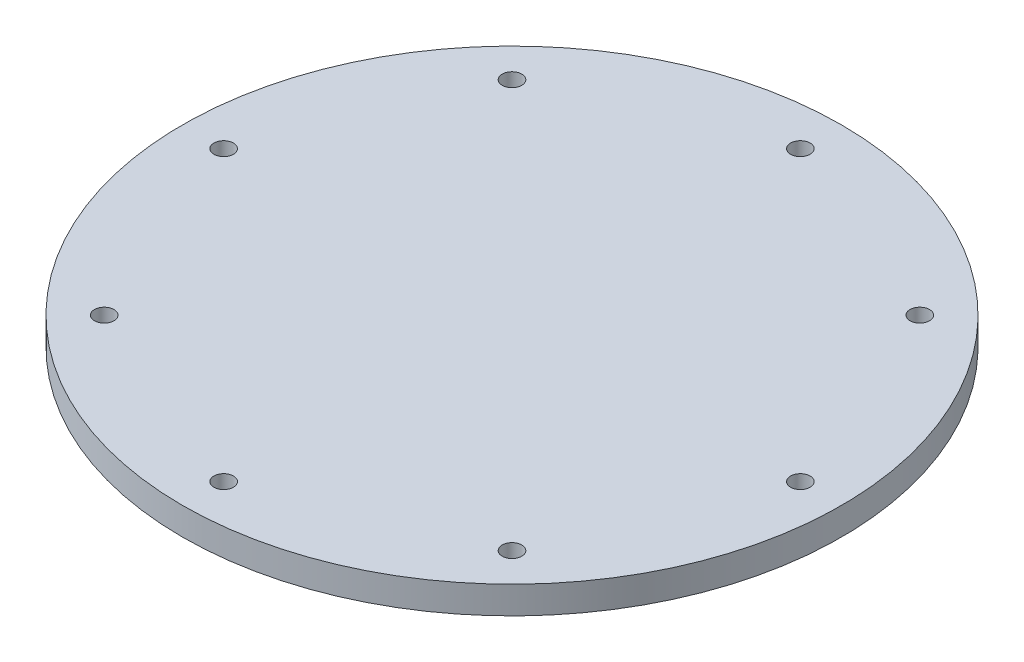
ISO-10303-21;
HEADER;
FILE_DESCRIPTION(('STEP AP214'),'2;1');
FILE_NAME('part.step','',(''),(''),'','','');
FILE_SCHEMA(('AUTOMOTIVE_DESIGN { 1 0 10303 214 1 1 1 1 }'));
ENDSEC;
DATA;
#1=APPLICATION_CONTEXT('core data for automotive mechanical design processes');
#2=APPLICATION_PROTOCOL_DEFINITION('international standard','automotive_design',2000,#1);
#3=PRODUCT_CONTEXT('',#1,'mechanical');
#4=PRODUCT('Part','Part','',(#3));
#5=PRODUCT_RELATED_PRODUCT_CATEGORY('part','',(#4));
#6=PRODUCT_DEFINITION_FORMATION('','',#4);
#7=PRODUCT_DEFINITION_CONTEXT('part definition',#1,'design');
#8=PRODUCT_DEFINITION('design','',#6,#7);
#9=PRODUCT_DEFINITION_SHAPE('','',#8);
#10=(LENGTH_UNIT() NAMED_UNIT(*) SI_UNIT(.MILLI.,.METRE.));
#11=(NAMED_UNIT(*) PLANE_ANGLE_UNIT() SI_UNIT($,.RADIAN.));
#12=(NAMED_UNIT(*) SI_UNIT($,.STERADIAN.) SOLID_ANGLE_UNIT());
#13=UNCERTAINTY_MEASURE_WITH_UNIT(LENGTH_MEASURE(1.E-05),#10,'distance_accuracy_value','');
#14=(GEOMETRIC_REPRESENTATION_CONTEXT(3) GLOBAL_UNCERTAINTY_ASSIGNED_CONTEXT((#13)) GLOBAL_UNIT_ASSIGNED_CONTEXT((#10,
#11,#12)) REPRESENTATION_CONTEXT('',''));
#15=CARTESIAN_POINT('',(0.,0.,0.));
#16=DIRECTION('',(0.,0.,1.));
#17=DIRECTION('',(1.,0.,0.));
#18=AXIS2_PLACEMENT_3D('',#15,#16,#17);
#19=CARTESIAN_POINT('',(0.,3.175,0.));
#20=DIRECTION('',(0.,-1.,0.));
#21=DIRECTION('',(0.,0.,-1.));
#22=AXIS2_PLACEMENT_3D('',#19,#20,#21);
#23=CYLINDRICAL_SURFACE('',#22,38.1);
#24=CARTESIAN_POINT('',(0.,3.175,0.));
#25=DIRECTION('',(0.,1.,0.));
#26=DIRECTION('',(0.,0.,1.));
#27=AXIS2_PLACEMENT_3D('',#24,#25,#26);
#28=CIRCLE('',#27,38.1);
#29=CARTESIAN_POINT('',(0.,3.175,38.1));
#30=VERTEX_POINT('',#29);
#31=EDGE_CURVE('E10',#30,#30,#28,.T.);
#32=ORIENTED_EDGE('',*,*,#31,.F.);
#33=EDGE_LOOP('',(#32));
#34=FACE_BOUND('',#33,.T.);
#35=CARTESIAN_POINT('',(0.,0.,0.));
#36=DIRECTION('',(0.,1.,0.));
#37=DIRECTION('',(0.,0.,1.));
#38=AXIS2_PLACEMENT_3D('',#35,#36,#37);
#39=CIRCLE('',#38,38.1);
#40=CARTESIAN_POINT('',(0.,0.,38.1));
#41=VERTEX_POINT('',#40);
#42=EDGE_CURVE('E35',#41,#41,#39,.T.);
#43=ORIENTED_EDGE('',*,*,#42,.T.);
#44=EDGE_LOOP('',(#43));
#45=FACE_BOUND('',#44,.T.);
#46=ADVANCED_FACE('F32',(#34,#45),#23,.T.);
#47=CARTESIAN_POINT('',(0.,3.175,0.));
#48=DIRECTION('',(0.,1.,0.));
#49=DIRECTION('',(0.,0.,1.));
#50=AXIS2_PLACEMENT_3D('',#47,#48,#49);
#51=PLANE('',#50);
#52=CARTESIAN_POINT('',(-23.5731723178062,3.175,23.5731723178068));
#53=DIRECTION('',(0.,-1.,0.));
#54=DIRECTION('',(0.,0.,-1.));
#55=AXIS2_PLACEMENT_3D('',#52,#53,#54);
#56=CIRCLE('',#55,1.1303);
#57=CARTESIAN_POINT('',(-23.5731723178062,3.175,22.4428723178068));
#58=VERTEX_POINT('',#57);
#59=EDGE_CURVE('E85',#58,#58,#56,.T.);
#60=ORIENTED_EDGE('',*,*,#59,.T.);
#61=EDGE_LOOP('',(#60));
#62=FACE_BOUND('',#61,.T.);
#63=CARTESIAN_POINT('',(-33.3375,3.175,3.49191777401049E-13));
#64=DIRECTION('',(0.,-1.,0.));
#65=DIRECTION('',(0.,0.,-1.));
#66=AXIS2_PLACEMENT_3D('',#63,#64,#65);
#67=CIRCLE('',#66,1.1303);
#68=CARTESIAN_POINT('',(-33.3375,3.175,-1.13029999999965));
#69=VERTEX_POINT('',#68);
#70=EDGE_CURVE('E79',#69,#69,#67,.T.);
#71=ORIENTED_EDGE('',*,*,#70,.T.);
#72=EDGE_LOOP('',(#71));
#73=FACE_BOUND('',#72,.T.);
#74=CARTESIAN_POINT('',(-23.5731723178067,3.175,-23.5731723178063));
#75=DIRECTION('',(0.,-1.,0.));
#76=DIRECTION('',(0.,0.,-1.));
#77=AXIS2_PLACEMENT_3D('',#74,#75,#76);
#78=CIRCLE('',#77,1.1303);
#79=CARTESIAN_POINT('',(-23.5731723178067,3.175,-24.7034723178063));
#80=VERTEX_POINT('',#79);
#81=EDGE_CURVE('E73',#80,#80,#78,.T.);
#82=ORIENTED_EDGE('',*,*,#81,.T.);
#83=EDGE_LOOP('',(#82));
#84=FACE_BOUND('',#83,.T.);
#85=CARTESIAN_POINT('',(0.,3.175,-33.3375));
#86=DIRECTION('',(0.,-1.,0.));
#87=DIRECTION('',(0.,0.,-1.));
#88=AXIS2_PLACEMENT_3D('',#85,#86,#87);
#89=CIRCLE('',#88,1.1303);
#90=CARTESIAN_POINT('',(0.,3.175,-34.4678));
#91=VERTEX_POINT('',#90);
#92=EDGE_CURVE('E67',#91,#91,#89,.T.);
#93=ORIENTED_EDGE('',*,*,#92,.T.);
#94=EDGE_LOOP('',(#93));
#95=FACE_BOUND('',#94,.T.);
#96=CARTESIAN_POINT('',(23.5731723178064,3.175,-23.5731723178067));
#97=DIRECTION('',(0.,-1.,0.));
#98=DIRECTION('',(0.,0.,-1.));
#99=AXIS2_PLACEMENT_3D('',#96,#97,#98);
#100=CIRCLE('',#99,1.1303);
#101=CARTESIAN_POINT('',(23.5731723178064,3.175,-24.7034723178067));
#102=VERTEX_POINT('',#101);
#103=EDGE_CURVE('E61',#102,#102,#100,.T.);
#104=ORIENTED_EDGE('',*,*,#103,.T.);
#105=EDGE_LOOP('',(#104));
#106=FACE_BOUND('',#105,.T.);
#107=CARTESIAN_POINT('',(33.3375,3.175,-1.16397259133683E-13));
#108=DIRECTION('',(0.,-1.,0.));
#109=DIRECTION('',(0.,0.,-1.));
#110=AXIS2_PLACEMENT_3D('',#107,#108,#109);
#111=CIRCLE('',#110,1.1303);
#112=CARTESIAN_POINT('',(33.3375,3.175,-1.13030000000012));
#113=VERTEX_POINT('',#112);
#114=EDGE_CURVE('E55',#113,#113,#111,.T.);
#115=ORIENTED_EDGE('',*,*,#114,.T.);
#116=EDGE_LOOP('',(#115));
#117=FACE_BOUND('',#116,.T.);
#118=CARTESIAN_POINT('',(23.5731723178066,3.175,23.5731723178065));
#119=DIRECTION('',(0.,-1.,0.));
#120=DIRECTION('',(0.,0.,-1.));
#121=AXIS2_PLACEMENT_3D('',#118,#119,#120);
#122=CIRCLE('',#121,1.1303);
#123=CARTESIAN_POINT('',(23.5731723178066,3.175,22.4428723178065));
#124=VERTEX_POINT('',#123);
#125=EDGE_CURVE('E49',#124,#124,#122,.T.);
#126=ORIENTED_EDGE('',*,*,#125,.T.);
#127=EDGE_LOOP('',(#126));
#128=FACE_BOUND('',#127,.T.);
#129=CARTESIAN_POINT('',(0.,3.175,33.3375));
#130=DIRECTION('',(0.,-1.,0.));
#131=DIRECTION('',(0.,0.,-1.));
#132=AXIS2_PLACEMENT_3D('',#129,#130,#131);
#133=CIRCLE('',#132,1.1303);
#134=CARTESIAN_POINT('',(0.,3.175,32.2072));
#135=VERTEX_POINT('',#134);
#136=EDGE_CURVE('E42',#135,#135,#133,.T.);
#137=ORIENTED_EDGE('',*,*,#136,.T.);
#138=EDGE_LOOP('',(#137));
#139=FACE_BOUND('',#138,.T.);
#140=ORIENTED_EDGE('',*,*,#31,.T.);
#141=EDGE_LOOP('',(#140));
#142=FACE_BOUND('',#141,.T.);
#143=ADVANCED_FACE('F98',(#62,#73,#84,#95,#106,#117,#128,#139,#142),#51,.T.);
#144=CARTESIAN_POINT('',(0.,0.,0.));
#145=DIRECTION('',(0.,1.,0.));
#146=DIRECTION('',(0.,0.,1.));
#147=AXIS2_PLACEMENT_3D('',#144,#145,#146);
#148=PLANE('',#147);
#149=CARTESIAN_POINT('',(-23.5731723178062,0.,23.5731723178068));
#150=DIRECTION('',(0.,-1.,0.));
#151=DIRECTION('',(0.,0.,-1.));
#152=AXIS2_PLACEMENT_3D('',#149,#150,#151);
#153=CIRCLE('',#152,1.13029999999999);
#154=CARTESIAN_POINT('',(-23.5731723178062,0.,22.4428723178068));
#155=VERTEX_POINT('',#154);
#156=EDGE_CURVE('E88',#155,#155,#153,.T.);
#157=ORIENTED_EDGE('',*,*,#156,.F.);
#158=EDGE_LOOP('',(#157));
#159=FACE_BOUND('',#158,.T.);
#160=CARTESIAN_POINT('',(-33.3375,0.,3.49191777401049E-13));
#161=DIRECTION('',(0.,-1.,0.));
#162=DIRECTION('',(0.,0.,-1.));
#163=AXIS2_PLACEMENT_3D('',#160,#161,#162);
#164=CIRCLE('',#163,1.13029999999999);
#165=CARTESIAN_POINT('',(-33.3375,0.,-1.13029999999964));
#166=VERTEX_POINT('',#165);
#167=EDGE_CURVE('E82',#166,#166,#164,.T.);
#168=ORIENTED_EDGE('',*,*,#167,.F.);
#169=EDGE_LOOP('',(#168));
#170=FACE_BOUND('',#169,.T.);
#171=CARTESIAN_POINT('',(-23.5731723178067,0.,-23.5731723178063));
#172=DIRECTION('',(0.,-1.,0.));
#173=DIRECTION('',(0.,0.,-1.));
#174=AXIS2_PLACEMENT_3D('',#171,#172,#173);
#175=CIRCLE('',#174,1.13029999999999);
#176=CARTESIAN_POINT('',(-23.5731723178067,0.,-24.7034723178063));
#177=VERTEX_POINT('',#176);
#178=EDGE_CURVE('E76',#177,#177,#175,.T.);
#179=ORIENTED_EDGE('',*,*,#178,.F.);
#180=EDGE_LOOP('',(#179));
#181=FACE_BOUND('',#180,.T.);
#182=CARTESIAN_POINT('',(0.,0.,-33.3375));
#183=DIRECTION('',(0.,-1.,0.));
#184=DIRECTION('',(0.,0.,-1.));
#185=AXIS2_PLACEMENT_3D('',#182,#183,#184);
#186=CIRCLE('',#185,1.13029999999999);
#187=CARTESIAN_POINT('',(0.,0.,-34.4678));
#188=VERTEX_POINT('',#187);
#189=EDGE_CURVE('E70',#188,#188,#186,.T.);
#190=ORIENTED_EDGE('',*,*,#189,.F.);
#191=EDGE_LOOP('',(#190));
#192=FACE_BOUND('',#191,.T.);
#193=CARTESIAN_POINT('',(23.5731723178064,0.,-23.5731723178067));
#194=DIRECTION('',(0.,-1.,0.));
#195=DIRECTION('',(0.,0.,-1.));
#196=AXIS2_PLACEMENT_3D('',#193,#194,#195);
#197=CIRCLE('',#196,1.13029999999999);
#198=CARTESIAN_POINT('',(23.5731723178064,0.,-24.7034723178066));
#199=VERTEX_POINT('',#198);
#200=EDGE_CURVE('E64',#199,#199,#197,.T.);
#201=ORIENTED_EDGE('',*,*,#200,.F.);
#202=EDGE_LOOP('',(#201));
#203=FACE_BOUND('',#202,.T.);
#204=CARTESIAN_POINT('',(33.3375,0.,-1.16397259133683E-13));
#205=DIRECTION('',(0.,-1.,0.));
#206=DIRECTION('',(0.,0.,-1.));
#207=AXIS2_PLACEMENT_3D('',#204,#205,#206);
#208=CIRCLE('',#207,1.13029999999999);
#209=CARTESIAN_POINT('',(33.3375,0.,-1.1303000000001));
#210=VERTEX_POINT('',#209);
#211=EDGE_CURVE('E58',#210,#210,#208,.T.);
#212=ORIENTED_EDGE('',*,*,#211,.F.);
#213=EDGE_LOOP('',(#212));
#214=FACE_BOUND('',#213,.T.);
#215=CARTESIAN_POINT('',(23.5731723178066,0.,23.5731723178065));
#216=DIRECTION('',(0.,-1.,0.));
#217=DIRECTION('',(0.,0.,-1.));
#218=AXIS2_PLACEMENT_3D('',#215,#216,#217);
#219=CIRCLE('',#218,1.13029999999999);
#220=CARTESIAN_POINT('',(23.5731723178066,0.,22.4428723178065));
#221=VERTEX_POINT('',#220);
#222=EDGE_CURVE('E52',#221,#221,#219,.T.);
#223=ORIENTED_EDGE('',*,*,#222,.F.);
#224=EDGE_LOOP('',(#223));
#225=FACE_BOUND('',#224,.T.);
#226=CARTESIAN_POINT('',(0.,0.,33.3375));
#227=DIRECTION('',(0.,-1.,0.));
#228=DIRECTION('',(0.,0.,-1.));
#229=AXIS2_PLACEMENT_3D('',#226,#227,#228);
#230=CIRCLE('',#229,1.13029999999999);
#231=CARTESIAN_POINT('',(0.,0.,32.2072));
#232=VERTEX_POINT('',#231);
#233=EDGE_CURVE('E46',#232,#232,#230,.T.);
#234=ORIENTED_EDGE('',*,*,#233,.F.);
#235=EDGE_LOOP('',(#234));
#236=FACE_BOUND('',#235,.T.);
#237=ORIENTED_EDGE('',*,*,#42,.F.);
#238=EDGE_LOOP('',(#237));
#239=FACE_BOUND('',#238,.T.);
#240=ADVANCED_FACE('F94',(#159,#170,#181,#192,#203,#214,#225,#236,#239),#148,.F.);
#241=CARTESIAN_POINT('',(0.,0.,33.3375));
#242=DIRECTION('',(0.,-1.,0.));
#243=DIRECTION('',(0.,0.,-1.));
#244=AXIS2_PLACEMENT_3D('',#241,#242,#243);
#245=CYLINDRICAL_SURFACE('',#244,1.13029999999999);
#246=ORIENTED_EDGE('',*,*,#136,.F.);
#247=EDGE_LOOP('',(#246));
#248=FACE_BOUND('',#247,.T.);
#249=ORIENTED_EDGE('',*,*,#233,.T.);
#250=EDGE_LOOP('',(#249));
#251=FACE_BOUND('',#250,.T.);
#252=ADVANCED_FACE('F97',(#248,#251),#245,.F.);
#253=CARTESIAN_POINT('',(23.5731723178066,0.,23.5731723178065));
#254=DIRECTION('',(0.,-1.,0.));
#255=DIRECTION('',(0.,0.,-1.));
#256=AXIS2_PLACEMENT_3D('',#253,#254,#255);
#257=CYLINDRICAL_SURFACE('',#256,1.13029999999999);
#258=ORIENTED_EDGE('',*,*,#125,.F.);
#259=EDGE_LOOP('',(#258));
#260=FACE_BOUND('',#259,.T.);
#261=ORIENTED_EDGE('',*,*,#222,.T.);
#262=EDGE_LOOP('',(#261));
#263=FACE_BOUND('',#262,.T.);
#264=ADVANCED_FACE('F129',(#260,#263),#257,.F.);
#265=CARTESIAN_POINT('',(33.3375,0.,-1.16397259133683E-13));
#266=DIRECTION('',(0.,-1.,0.));
#267=DIRECTION('',(0.,0.,-1.));
#268=AXIS2_PLACEMENT_3D('',#265,#266,#267);
#269=CYLINDRICAL_SURFACE('',#268,1.13029999999999);
#270=ORIENTED_EDGE('',*,*,#114,.F.);
#271=EDGE_LOOP('',(#270));
#272=FACE_BOUND('',#271,.T.);
#273=ORIENTED_EDGE('',*,*,#211,.T.);
#274=EDGE_LOOP('',(#273));
#275=FACE_BOUND('',#274,.T.);
#276=ADVANCED_FACE('F133',(#272,#275),#269,.F.);
#277=CARTESIAN_POINT('',(23.5731723178064,0.,-23.5731723178067));
#278=DIRECTION('',(0.,-1.,0.));
#279=DIRECTION('',(0.,0.,-1.));
#280=AXIS2_PLACEMENT_3D('',#277,#278,#279);
#281=CYLINDRICAL_SURFACE('',#280,1.13029999999999);
#282=ORIENTED_EDGE('',*,*,#103,.F.);
#283=EDGE_LOOP('',(#282));
#284=FACE_BOUND('',#283,.T.);
#285=ORIENTED_EDGE('',*,*,#200,.T.);
#286=EDGE_LOOP('',(#285));
#287=FACE_BOUND('',#286,.T.);
#288=ADVANCED_FACE('F137',(#284,#287),#281,.F.);
#289=CARTESIAN_POINT('',(0.,0.,-33.3375));
#290=DIRECTION('',(0.,-1.,0.));
#291=DIRECTION('',(0.,0.,-1.));
#292=AXIS2_PLACEMENT_3D('',#289,#290,#291);
#293=CYLINDRICAL_SURFACE('',#292,1.13029999999999);
#294=ORIENTED_EDGE('',*,*,#92,.F.);
#295=EDGE_LOOP('',(#294));
#296=FACE_BOUND('',#295,.T.);
#297=ORIENTED_EDGE('',*,*,#189,.T.);
#298=EDGE_LOOP('',(#297));
#299=FACE_BOUND('',#298,.T.);
#300=ADVANCED_FACE('F141',(#296,#299),#293,.F.);
#301=CARTESIAN_POINT('',(-23.5731723178067,0.,-23.5731723178063));
#302=DIRECTION('',(0.,-1.,0.));
#303=DIRECTION('',(0.,0.,-1.));
#304=AXIS2_PLACEMENT_3D('',#301,#302,#303);
#305=CYLINDRICAL_SURFACE('',#304,1.13029999999999);
#306=ORIENTED_EDGE('',*,*,#81,.F.);
#307=EDGE_LOOP('',(#306));
#308=FACE_BOUND('',#307,.T.);
#309=ORIENTED_EDGE('',*,*,#178,.T.);
#310=EDGE_LOOP('',(#309));
#311=FACE_BOUND('',#310,.T.);
#312=ADVANCED_FACE('F145',(#308,#311),#305,.F.);
#313=CARTESIAN_POINT('',(-33.3375,0.,3.49191777401049E-13));
#314=DIRECTION('',(0.,-1.,0.));
#315=DIRECTION('',(0.,0.,-1.));
#316=AXIS2_PLACEMENT_3D('',#313,#314,#315);
#317=CYLINDRICAL_SURFACE('',#316,1.13029999999999);
#318=ORIENTED_EDGE('',*,*,#70,.F.);
#319=EDGE_LOOP('',(#318));
#320=FACE_BOUND('',#319,.T.);
#321=ORIENTED_EDGE('',*,*,#167,.T.);
#322=EDGE_LOOP('',(#321));
#323=FACE_BOUND('',#322,.T.);
#324=ADVANCED_FACE('F149',(#320,#323),#317,.F.);
#325=CARTESIAN_POINT('',(-23.5731723178062,0.,23.5731723178068));
#326=DIRECTION('',(0.,-1.,0.));
#327=DIRECTION('',(0.,0.,-1.));
#328=AXIS2_PLACEMENT_3D('',#325,#326,#327);
#329=CYLINDRICAL_SURFACE('',#328,1.13029999999999);
#330=ORIENTED_EDGE('',*,*,#59,.F.);
#331=EDGE_LOOP('',(#330));
#332=FACE_BOUND('',#331,.T.);
#333=ORIENTED_EDGE('',*,*,#156,.T.);
#334=EDGE_LOOP('',(#333));
#335=FACE_BOUND('',#334,.T.);
#336=ADVANCED_FACE('F92',(#332,#335),#329,.F.);
#337=CLOSED_SHELL('',(#46,#143,#240,#252,#264,#276,#288,#300,#312,#324,#336));
#338=MANIFOLD_SOLID_BREP('B2',#337);
#339=ADVANCED_BREP_SHAPE_REPRESENTATION('',(#18,#338),#14);
#340=SHAPE_DEFINITION_REPRESENTATION(#9,#339);
ENDSEC;
END-ISO-10303-21;
